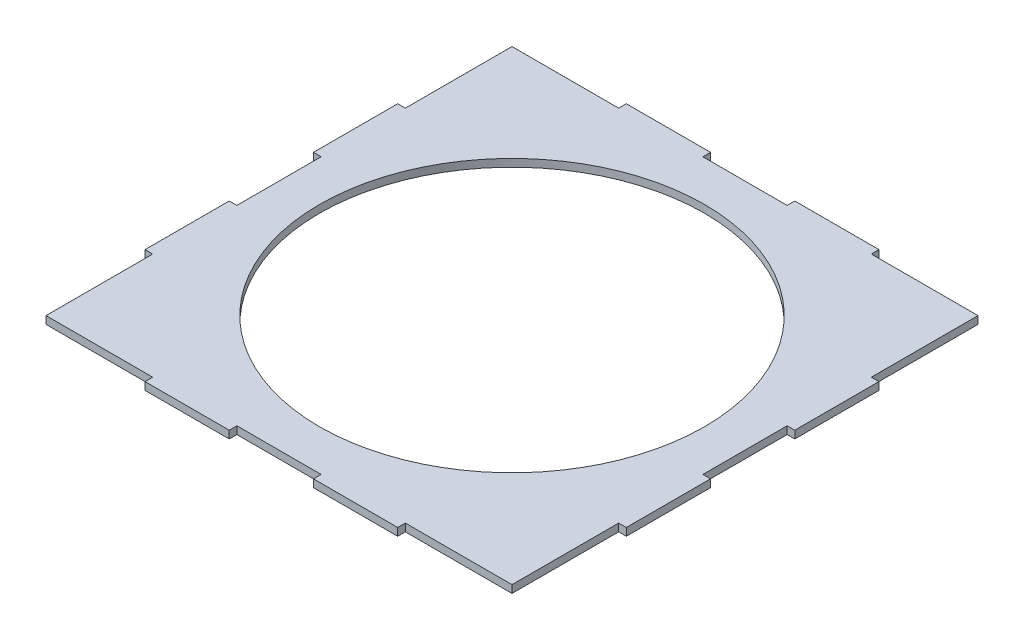
ISO-10303-21;
HEADER;
FILE_DESCRIPTION(('STEP AP214'),'2;1');
FILE_NAME('part.step','',(''),(''),'','','');
FILE_SCHEMA(('AUTOMOTIVE_DESIGN { 1 0 10303 214 1 1 1 1 }'));
ENDSEC;
DATA;
#1=APPLICATION_CONTEXT('core data for automotive mechanical design processes');
#2=APPLICATION_PROTOCOL_DEFINITION('international standard','automotive_design',2000,#1);
#3=PRODUCT_CONTEXT('',#1,'mechanical');
#4=PRODUCT('Part','Part','',(#3));
#5=PRODUCT_RELATED_PRODUCT_CATEGORY('part','',(#4));
#6=PRODUCT_DEFINITION_FORMATION('','',#4);
#7=PRODUCT_DEFINITION_CONTEXT('part definition',#1,'design');
#8=PRODUCT_DEFINITION('design','',#6,#7);
#9=PRODUCT_DEFINITION_SHAPE('','',#8);
#10=(LENGTH_UNIT() NAMED_UNIT(*) SI_UNIT(.MILLI.,.METRE.));
#11=(NAMED_UNIT(*) PLANE_ANGLE_UNIT() SI_UNIT($,.RADIAN.));
#12=(NAMED_UNIT(*) SI_UNIT($,.STERADIAN.) SOLID_ANGLE_UNIT());
#13=UNCERTAINTY_MEASURE_WITH_UNIT(LENGTH_MEASURE(1.E-05),#10,'distance_accuracy_value','');
#14=(GEOMETRIC_REPRESENTATION_CONTEXT(3) GLOBAL_UNCERTAINTY_ASSIGNED_CONTEXT((#13)) GLOBAL_UNIT_ASSIGNED_CONTEXT((#10,
#11,#12)) REPRESENTATION_CONTEXT('',''));
#15=CARTESIAN_POINT('',(0.,0.,0.));
#16=DIRECTION('',(0.,0.,1.));
#17=DIRECTION('',(1.,0.,0.));
#18=AXIS2_PLACEMENT_3D('',#15,#16,#17);
#19=CARTESIAN_POINT('',(-100.,3.175,100.));
#20=DIRECTION('',(0.,0.,-1.));
#21=DIRECTION('',(-1.,0.,0.));
#22=AXIS2_PLACEMENT_3D('',#19,#20,#21);
#23=PLANE('',#22);
#24=DIRECTION('',(0.,1.,0.));
#25=VECTOR('',#24,1.);
#26=CARTESIAN_POINT('',(-52.5,0.,100.));
#27=LINE('',#26,#25);
#28=CARTESIAN_POINT('',(-52.5,0.,100.));
#29=VERTEX_POINT('',#28);
#30=CARTESIAN_POINT('',(-52.5,3.175,100.));
#31=VERTEX_POINT('',#30);
#32=EDGE_CURVE('E277',#29,#31,#27,.T.);
#33=ORIENTED_EDGE('',*,*,#32,.F.);
#34=DIRECTION('',(1.,0.,0.));
#35=VECTOR('',#34,1.);
#36=CARTESIAN_POINT('',(-100.,0.,100.));
#37=LINE('',#36,#35);
#38=CARTESIAN_POINT('',(-17.5,0.,100.));
#39=VERTEX_POINT('',#38);
#40=EDGE_CURVE('E290',#29,#39,#37,.T.);
#41=ORIENTED_EDGE('',*,*,#40,.T.);
#42=DIRECTION('',(0.,1.,0.));
#43=VECTOR('',#42,1.);
#44=CARTESIAN_POINT('',(-17.5,0.,100.));
#45=LINE('',#44,#43);
#46=CARTESIAN_POINT('',(-17.5,3.175,100.));
#47=VERTEX_POINT('',#46);
#48=EDGE_CURVE('E600',#39,#47,#45,.T.);
#49=ORIENTED_EDGE('',*,*,#48,.T.);
#50=DIRECTION('',(1.,0.,0.));
#51=VECTOR('',#50,1.);
#52=CARTESIAN_POINT('',(-100.,3.175,100.));
#53=LINE('',#52,#51);
#54=EDGE_CURVE('E292',#31,#47,#53,.T.);
#55=ORIENTED_EDGE('',*,*,#54,.F.);
#56=EDGE_LOOP('',(#33,#41,#49,#55));
#57=FACE_BOUND('',#56,.T.);
#58=ADVANCED_FACE('F37',(#57),#23,.F.);
#59=DIRECTION('',(0.,1.,0.));
#60=VECTOR('',#59,1.);
#61=CARTESIAN_POINT('',(17.5,0.,100.));
#62=LINE('',#61,#60);
#63=CARTESIAN_POINT('',(17.5,0.,100.));
#64=VERTEX_POINT('',#63);
#65=CARTESIAN_POINT('',(17.5,3.175,100.));
#66=VERTEX_POINT('',#65);
#67=EDGE_CURVE('E603',#64,#66,#62,.T.);
#68=ORIENTED_EDGE('',*,*,#67,.F.);
#69=CARTESIAN_POINT('',(52.5,0.,100.));
#70=VERTEX_POINT('',#69);
#71=EDGE_CURVE('E301',#64,#70,#37,.T.);
#72=ORIENTED_EDGE('',*,*,#71,.T.);
#73=DIRECTION('',(0.,1.,0.));
#74=VECTOR('',#73,1.);
#75=CARTESIAN_POINT('',(52.5,0.,100.));
#76=LINE('',#75,#74);
#77=CARTESIAN_POINT('',(52.5,3.175,100.));
#78=VERTEX_POINT('',#77);
#79=EDGE_CURVE('E581',#70,#78,#76,.T.);
#80=ORIENTED_EDGE('',*,*,#79,.T.);
#81=EDGE_CURVE('E322',#66,#78,#53,.T.);
#82=ORIENTED_EDGE('',*,*,#81,.F.);
#83=EDGE_LOOP('',(#68,#72,#80,#82));
#84=FACE_BOUND('',#83,.T.);
#85=ADVANCED_FACE('F661',(#84),#23,.F.);
#86=CARTESIAN_POINT('',(0.,3.175,0.));
#87=DIRECTION('',(0.,1.,0.));
#88=DIRECTION('',(0.,0.,1.));
#89=AXIS2_PLACEMENT_3D('',#86,#87,#88);
#90=PLANE('',#89);
#91=CARTESIAN_POINT('',(0.,3.175,0.));
#92=DIRECTION('',(0.,1.,0.));
#93=DIRECTION('',(0.,0.,1.));
#94=AXIS2_PLACEMENT_3D('',#91,#92,#93);
#95=CIRCLE('',#94,80.);
#96=CARTESIAN_POINT('',(0.,3.175,80.));
#97=VERTEX_POINT('',#96);
#98=EDGE_CURVE('E642',#97,#97,#95,.T.);
#99=ORIENTED_EDGE('',*,*,#98,.F.);
#100=EDGE_LOOP('',(#99));
#101=FACE_BOUND('',#100,.T.);
#102=DIRECTION('',(0.,0.,-1.));
#103=VECTOR('',#102,1.);
#104=CARTESIAN_POINT('',(-96.825,3.175,100.));
#105=LINE('',#104,#103);
#106=CARTESIAN_POINT('',(-96.825,3.175,96.825));
#107=VERTEX_POINT('',#106);
#108=CARTESIAN_POINT('',(-96.825,3.175,52.5));
#109=VERTEX_POINT('',#108);
#110=EDGE_CURVE('E382',#107,#109,#105,.T.);
#111=ORIENTED_EDGE('',*,*,#110,.F.);
#112=DIRECTION('',(1.,0.,0.));
#113=VECTOR('',#112,1.);
#114=CARTESIAN_POINT('',(-96.825,3.175,96.825));
#115=LINE('',#114,#113);
#116=CARTESIAN_POINT('',(-52.5,3.175,96.825));
#117=VERTEX_POINT('',#116);
#118=EDGE_CURVE('E63',#107,#117,#115,.T.);
#119=ORIENTED_EDGE('',*,*,#118,.T.);
#120=DIRECTION('',(0.,0.,1.));
#121=VECTOR('',#120,1.);
#122=CARTESIAN_POINT('',(-52.5,3.175,100.));
#123=LINE('',#122,#121);
#124=EDGE_CURVE('E613',#117,#31,#123,.T.);
#125=ORIENTED_EDGE('',*,*,#124,.T.);
#126=ORIENTED_EDGE('',*,*,#54,.T.);
#127=DIRECTION('',(0.,0.,-1.));
#128=VECTOR('',#127,1.);
#129=CARTESIAN_POINT('',(-17.5,3.175,100.));
#130=LINE('',#129,#128);
#131=CARTESIAN_POINT('',(-17.5,3.175,96.825));
#132=VERTEX_POINT('',#131);
#133=EDGE_CURVE('E585',#47,#132,#130,.T.);
#134=ORIENTED_EDGE('',*,*,#133,.T.);
#135=DIRECTION('',(1.,0.,0.));
#136=VECTOR('',#135,1.);
#137=CARTESIAN_POINT('',(-17.5,3.175,96.825));
#138=LINE('',#137,#136);
#139=CARTESIAN_POINT('',(17.5,3.175,96.825));
#140=VERTEX_POINT('',#139);
#141=EDGE_CURVE('E614',#132,#140,#138,.T.);
#142=ORIENTED_EDGE('',*,*,#141,.T.);
#143=DIRECTION('',(0.,0.,1.));
#144=VECTOR('',#143,1.);
#145=CARTESIAN_POINT('',(17.5,3.175,100.));
#146=LINE('',#145,#144);
#147=EDGE_CURVE('E618',#140,#66,#146,.T.);
#148=ORIENTED_EDGE('',*,*,#147,.T.);
#149=ORIENTED_EDGE('',*,*,#81,.T.);
#150=DIRECTION('',(0.,0.,-1.));
#151=VECTOR('',#150,1.);
#152=CARTESIAN_POINT('',(52.5,3.175,100.));
#153=LINE('',#152,#151);
#154=CARTESIAN_POINT('',(52.5,3.175,96.825));
#155=VERTEX_POINT('',#154);
#156=EDGE_CURVE('E586',#78,#155,#153,.T.);
#157=ORIENTED_EDGE('',*,*,#156,.T.);
#158=DIRECTION('',(1.,0.,0.));
#159=VECTOR('',#158,1.);
#160=CARTESIAN_POINT('',(96.825,3.175,96.825));
#161=LINE('',#160,#159);
#162=CARTESIAN_POINT('',(96.825,3.175,96.825));
#163=VERTEX_POINT('',#162);
#164=EDGE_CURVE('E591',#155,#163,#161,.T.);
#165=ORIENTED_EDGE('',*,*,#164,.T.);
#166=DIRECTION('',(0.,0.,-1.));
#167=VECTOR('',#166,1.);
#168=CARTESIAN_POINT('',(96.825,3.175,100.));
#169=LINE('',#168,#167);
#170=CARTESIAN_POINT('',(96.825,3.175,52.5));
#171=VERTEX_POINT('',#170);
#172=EDGE_CURVE('E455',#163,#171,#169,.T.);
#173=ORIENTED_EDGE('',*,*,#172,.T.);
#174=DIRECTION('',(1.,0.,0.));
#175=VECTOR('',#174,1.);
#176=CARTESIAN_POINT('',(100.,3.175,52.5));
#177=LINE('',#176,#175);
#178=CARTESIAN_POINT('',(100.,3.175,52.5));
#179=VERTEX_POINT('',#178);
#180=EDGE_CURVE('E459',#171,#179,#177,.T.);
#181=ORIENTED_EDGE('',*,*,#180,.T.);
#182=DIRECTION('',(0.,0.,-1.));
#183=VECTOR('',#182,1.);
#184=CARTESIAN_POINT('',(100.,3.175,-100.));
#185=LINE('',#184,#183);
#186=CARTESIAN_POINT('',(100.,3.175,17.5));
#187=VERTEX_POINT('',#186);
#188=EDGE_CURVE('E317',#179,#187,#185,.T.);
#189=ORIENTED_EDGE('',*,*,#188,.T.);
#190=DIRECTION('',(-1.,0.,0.));
#191=VECTOR('',#190,1.);
#192=CARTESIAN_POINT('',(100.,3.175,17.5));
#193=LINE('',#192,#191);
#194=CARTESIAN_POINT('',(96.825,3.175,17.5));
#195=VERTEX_POINT('',#194);
#196=EDGE_CURVE('E424',#187,#195,#193,.T.);
#197=ORIENTED_EDGE('',*,*,#196,.T.);
#198=DIRECTION('',(0.,0.,-1.));
#199=VECTOR('',#198,1.);
#200=CARTESIAN_POINT('',(96.825,3.175,-17.5));
#201=LINE('',#200,#199);
#202=CARTESIAN_POINT('',(96.825,3.175,-17.5));
#203=VERTEX_POINT('',#202);
#204=EDGE_CURVE('E429',#195,#203,#201,.T.);
#205=ORIENTED_EDGE('',*,*,#204,.T.);
#206=DIRECTION('',(1.,0.,0.));
#207=VECTOR('',#206,1.);
#208=CARTESIAN_POINT('',(100.,3.175,-17.5));
#209=LINE('',#208,#207);
#210=CARTESIAN_POINT('',(100.,3.175,-17.5));
#211=VERTEX_POINT('',#210);
#212=EDGE_CURVE('E433',#203,#211,#209,.T.);
#213=ORIENTED_EDGE('',*,*,#212,.T.);
#214=CARTESIAN_POINT('',(100.,3.175,-52.5));
#215=VERTEX_POINT('',#214);
#216=EDGE_CURVE('E318',#211,#215,#185,.T.);
#217=ORIENTED_EDGE('',*,*,#216,.T.);
#218=DIRECTION('',(-1.,0.,0.));
#219=VECTOR('',#218,1.);
#220=CARTESIAN_POINT('',(96.825,3.175,-52.5));
#221=LINE('',#220,#219);
#222=CARTESIAN_POINT('',(96.825,3.175,-52.5));
#223=VERTEX_POINT('',#222);
#224=EDGE_CURVE('E475',#215,#223,#221,.T.);
#225=ORIENTED_EDGE('',*,*,#224,.T.);
#226=DIRECTION('',(0.,0.,-1.));
#227=VECTOR('',#226,1.);
#228=CARTESIAN_POINT('',(96.825,3.175,-52.5));
#229=LINE('',#228,#227);
#230=CARTESIAN_POINT('',(96.825,3.175,-96.825));
#231=VERTEX_POINT('',#230);
#232=EDGE_CURVE('E454',#223,#231,#229,.T.);
#233=ORIENTED_EDGE('',*,*,#232,.T.);
#234=DIRECTION('',(1.,0.,0.));
#235=VECTOR('',#234,1.);
#236=CARTESIAN_POINT('',(96.825,3.175,-96.825));
#237=LINE('',#236,#235);
#238=CARTESIAN_POINT('',(52.5,3.175,-96.825));
#239=VERTEX_POINT('',#238);
#240=EDGE_CURVE('E500',#239,#231,#237,.T.);
#241=ORIENTED_EDGE('',*,*,#240,.F.);
#242=DIRECTION('',(0.,0.,1.));
#243=VECTOR('',#242,1.);
#244=CARTESIAN_POINT('',(52.5,3.175,-100.));
#245=LINE('',#244,#243);
#246=CARTESIAN_POINT('',(52.5,3.175,-100.));
#247=VERTEX_POINT('',#246);
#248=EDGE_CURVE('E504',#247,#239,#245,.T.);
#249=ORIENTED_EDGE('',*,*,#248,.F.);
#250=DIRECTION('',(-1.,0.,0.));
#251=VECTOR('',#250,1.);
#252=CARTESIAN_POINT('',(-100.,3.175,-100.));
#253=LINE('',#252,#251);
#254=CARTESIAN_POINT('',(17.5,3.175,-100.));
#255=VERTEX_POINT('',#254);
#256=EDGE_CURVE('E11',#247,#255,#253,.T.);
#257=ORIENTED_EDGE('',*,*,#256,.T.);
#258=DIRECTION('',(0.,0.,-1.));
#259=VECTOR('',#258,1.);
#260=CARTESIAN_POINT('',(17.5,3.175,-100.));
#261=LINE('',#260,#259);
#262=CARTESIAN_POINT('',(17.5,3.175,-96.825));
#263=VERTEX_POINT('',#262);
#264=EDGE_CURVE('E530',#263,#255,#261,.T.);
#265=ORIENTED_EDGE('',*,*,#264,.F.);
#266=DIRECTION('',(1.,0.,0.));
#267=VECTOR('',#266,1.);
#268=CARTESIAN_POINT('',(-17.5,3.175,-96.825));
#269=LINE('',#268,#267);
#270=CARTESIAN_POINT('',(-17.5,3.175,-96.825));
#271=VERTEX_POINT('',#270);
#272=EDGE_CURVE('E534',#271,#263,#269,.T.);
#273=ORIENTED_EDGE('',*,*,#272,.F.);
#274=DIRECTION('',(0.,0.,1.));
#275=VECTOR('',#274,1.);
#276=CARTESIAN_POINT('',(-17.5,3.175,-100.));
#277=LINE('',#276,#275);
#278=CARTESIAN_POINT('',(-17.5,3.175,-100.));
#279=VERTEX_POINT('',#278);
#280=EDGE_CURVE('E499',#279,#271,#277,.T.);
#281=ORIENTED_EDGE('',*,*,#280,.F.);
#282=CARTESIAN_POINT('',(-52.5,3.175,-100.));
#283=VERTEX_POINT('',#282);
#284=EDGE_CURVE('E47',#279,#283,#253,.T.);
#285=ORIENTED_EDGE('',*,*,#284,.T.);
#286=DIRECTION('',(0.,0.,-1.));
#287=VECTOR('',#286,1.);
#288=CARTESIAN_POINT('',(-52.5,3.175,-100.));
#289=LINE('',#288,#287);
#290=CARTESIAN_POINT('',(-52.5,3.175,-96.825));
#291=VERTEX_POINT('',#290);
#292=EDGE_CURVE('E561',#291,#283,#289,.T.);
#293=ORIENTED_EDGE('',*,*,#292,.F.);
#294=DIRECTION('',(1.,0.,0.));
#295=VECTOR('',#294,1.);
#296=CARTESIAN_POINT('',(-96.825,3.175,-96.825));
#297=LINE('',#296,#295);
#298=CARTESIAN_POINT('',(-96.825,3.175,-96.825));
#299=VERTEX_POINT('',#298);
#300=EDGE_CURVE('E529',#299,#291,#297,.T.);
#301=ORIENTED_EDGE('',*,*,#300,.F.);
#302=DIRECTION('',(0.,0.,-1.));
#303=VECTOR('',#302,1.);
#304=CARTESIAN_POINT('',(-96.825,3.175,-52.5));
#305=LINE('',#304,#303);
#306=CARTESIAN_POINT('',(-96.825,3.175,-52.5));
#307=VERTEX_POINT('',#306);
#308=EDGE_CURVE('E377',#307,#299,#305,.T.);
#309=ORIENTED_EDGE('',*,*,#308,.F.);
#310=DIRECTION('',(1.,0.,0.));
#311=VECTOR('',#310,1.);
#312=CARTESIAN_POINT('',(-96.825,3.175,-52.5));
#313=LINE('',#312,#311);
#314=CARTESIAN_POINT('',(-100.,3.175,-52.5));
#315=VERTEX_POINT('',#314);
#316=EDGE_CURVE('E397',#315,#307,#313,.T.);
#317=ORIENTED_EDGE('',*,*,#316,.F.);
#318=DIRECTION('',(0.,0.,1.));
#319=VECTOR('',#318,1.);
#320=CARTESIAN_POINT('',(-100.,3.175,-100.));
#321=LINE('',#320,#319);
#322=CARTESIAN_POINT('',(-100.,3.175,-17.5));
#323=VERTEX_POINT('',#322);
#324=EDGE_CURVE('E326',#315,#323,#321,.T.);
#325=ORIENTED_EDGE('',*,*,#324,.T.);
#326=DIRECTION('',(-1.,0.,0.));
#327=VECTOR('',#326,1.);
#328=CARTESIAN_POINT('',(-100.,3.175,-17.5));
#329=LINE('',#328,#327);
#330=CARTESIAN_POINT('',(-96.825,3.175,-17.5));
#331=VERTEX_POINT('',#330);
#332=EDGE_CURVE('E345',#331,#323,#329,.T.);
#333=ORIENTED_EDGE('',*,*,#332,.F.);
#334=DIRECTION('',(0.,0.,-1.));
#335=VECTOR('',#334,1.);
#336=CARTESIAN_POINT('',(-96.825,3.175,-17.5));
#337=LINE('',#336,#335);
#338=CARTESIAN_POINT('',(-96.825,3.175,17.5));
#339=VERTEX_POINT('',#338);
#340=EDGE_CURVE('E349',#339,#331,#337,.T.);
#341=ORIENTED_EDGE('',*,*,#340,.F.);
#342=DIRECTION('',(1.,0.,0.));
#343=VECTOR('',#342,1.);
#344=CARTESIAN_POINT('',(-100.,3.175,17.5));
#345=LINE('',#344,#343);
#346=CARTESIAN_POINT('',(-100.,3.175,17.5));
#347=VERTEX_POINT('',#346);
#348=EDGE_CURVE('E353',#347,#339,#345,.T.);
#349=ORIENTED_EDGE('',*,*,#348,.F.);
#350=CARTESIAN_POINT('',(-100.,3.175,52.5));
#351=VERTEX_POINT('',#350);
#352=EDGE_CURVE('E327',#347,#351,#321,.T.);
#353=ORIENTED_EDGE('',*,*,#352,.T.);
#354=DIRECTION('',(-1.,0.,0.));
#355=VECTOR('',#354,1.);
#356=CARTESIAN_POINT('',(-100.,3.175,52.5));
#357=LINE('',#356,#355);
#358=EDGE_CURVE('E378',#109,#351,#357,.T.);
#359=ORIENTED_EDGE('',*,*,#358,.F.);
#360=EDGE_LOOP('',(#111,#119,#125,#126,#134,#142,#148,#149,#157,#165,#173,#181,#189,#197,#205,
#213,#217,#225,#233,#241,#249,#257,#265,#273,#281,#285,#293,#301,#309,#317,#325,#333,#341,#349,
#353,#359));
#361=FACE_BOUND('',#360,.T.);
#362=ADVANCED_FACE('F658',(#101,#361),#90,.T.);
#363=CARTESIAN_POINT('',(0.,0.,0.));
#364=DIRECTION('',(0.,1.,0.));
#365=DIRECTION('',(0.,0.,1.));
#366=AXIS2_PLACEMENT_3D('',#363,#364,#365);
#367=PLANE('',#366);
#368=CARTESIAN_POINT('',(0.,0.,0.));
#369=DIRECTION('',(0.,1.,0.));
#370=DIRECTION('',(0.,0.,1.));
#371=AXIS2_PLACEMENT_3D('',#368,#369,#370);
#372=CIRCLE('',#371,80.);
#373=CARTESIAN_POINT('',(0.,0.,80.));
#374=VERTEX_POINT('',#373);
#375=EDGE_CURVE('E595',#374,#374,#372,.T.);
#376=ORIENTED_EDGE('',*,*,#375,.T.);
#377=EDGE_LOOP('',(#376));
#378=FACE_BOUND('',#377,.T.);
#379=DIRECTION('',(1.,0.,0.));
#380=VECTOR('',#379,1.);
#381=CARTESIAN_POINT('',(-96.825,0.,96.825));
#382=LINE('',#381,#380);
#383=CARTESIAN_POINT('',(-96.825,0.,96.825));
#384=VERTEX_POINT('',#383);
#385=CARTESIAN_POINT('',(-52.5,0.,96.825));
#386=VERTEX_POINT('',#385);
#387=EDGE_CURVE('E284',#384,#386,#382,.T.);
#388=ORIENTED_EDGE('',*,*,#387,.F.);
#389=DIRECTION('',(0.,0.,-1.));
#390=VECTOR('',#389,1.);
#391=CARTESIAN_POINT('',(-96.825,0.,100.));
#392=LINE('',#391,#390);
#393=CARTESIAN_POINT('',(-96.825,0.,52.5));
#394=VERTEX_POINT('',#393);
#395=EDGE_CURVE('E381',#384,#394,#392,.T.);
#396=ORIENTED_EDGE('',*,*,#395,.T.);
#397=DIRECTION('',(-1.,0.,0.));
#398=VECTOR('',#397,1.);
#399=CARTESIAN_POINT('',(-100.,0.,52.5));
#400=LINE('',#399,#398);
#401=CARTESIAN_POINT('',(-100.,0.,52.5));
#402=VERTEX_POINT('',#401);
#403=EDGE_CURVE('E373',#394,#402,#400,.T.);
#404=ORIENTED_EDGE('',*,*,#403,.T.);
#405=DIRECTION('',(0.,0.,1.));
#406=VECTOR('',#405,1.);
#407=CARTESIAN_POINT('',(-100.,0.,-100.));
#408=LINE('',#407,#406);
#409=CARTESIAN_POINT('',(-100.,0.,17.5));
#410=VERTEX_POINT('',#409);
#411=EDGE_CURVE('E310',#410,#402,#408,.T.);
#412=ORIENTED_EDGE('',*,*,#411,.F.);
#413=DIRECTION('',(1.,0.,0.));
#414=VECTOR('',#413,1.);
#415=CARTESIAN_POINT('',(-100.,0.,17.5));
#416=LINE('',#415,#414);
#417=CARTESIAN_POINT('',(-96.825,0.,17.5));
#418=VERTEX_POINT('',#417);
#419=EDGE_CURVE('E348',#410,#418,#416,.T.);
#420=ORIENTED_EDGE('',*,*,#419,.T.);
#421=DIRECTION('',(0.,0.,-1.));
#422=VECTOR('',#421,1.);
#423=CARTESIAN_POINT('',(-96.825,0.,-17.5));
#424=LINE('',#423,#422);
#425=CARTESIAN_POINT('',(-96.825,0.,-17.5));
#426=VERTEX_POINT('',#425);
#427=EDGE_CURVE('E361',#418,#426,#424,.T.);
#428=ORIENTED_EDGE('',*,*,#427,.T.);
#429=DIRECTION('',(-1.,0.,0.));
#430=VECTOR('',#429,1.);
#431=CARTESIAN_POINT('',(-100.,0.,-17.5));
#432=LINE('',#431,#430);
#433=CARTESIAN_POINT('',(-100.,0.,-17.5));
#434=VERTEX_POINT('',#433);
#435=EDGE_CURVE('E336',#426,#434,#432,.T.);
#436=ORIENTED_EDGE('',*,*,#435,.T.);
#437=CARTESIAN_POINT('',(-100.,0.,-52.5));
#438=VERTEX_POINT('',#437);
#439=EDGE_CURVE('E308',#438,#434,#408,.T.);
#440=ORIENTED_EDGE('',*,*,#439,.F.);
#441=DIRECTION('',(1.,0.,0.));
#442=VECTOR('',#441,1.);
#443=CARTESIAN_POINT('',(-96.825,0.,-52.5));
#444=LINE('',#443,#442);
#445=CARTESIAN_POINT('',(-96.825,0.,-52.5));
#446=VERTEX_POINT('',#445);
#447=EDGE_CURVE('E394',#438,#446,#444,.T.);
#448=ORIENTED_EDGE('',*,*,#447,.T.);
#449=DIRECTION('',(0.,0.,-1.));
#450=VECTOR('',#449,1.);
#451=CARTESIAN_POINT('',(-96.825,0.,-52.5));
#452=LINE('',#451,#450);
#453=CARTESIAN_POINT('',(-96.825,0.,-96.825));
#454=VERTEX_POINT('',#453);
#455=EDGE_CURVE('E401',#446,#454,#452,.T.);
#456=ORIENTED_EDGE('',*,*,#455,.T.);
#457=DIRECTION('',(1.,0.,0.));
#458=VECTOR('',#457,1.);
#459=CARTESIAN_POINT('',(-96.825,0.,-96.825));
#460=LINE('',#459,#458);
#461=CARTESIAN_POINT('',(-52.5,0.,-96.825));
#462=VERTEX_POINT('',#461);
#463=EDGE_CURVE('E564',#454,#462,#460,.T.);
#464=ORIENTED_EDGE('',*,*,#463,.T.);
#465=DIRECTION('',(0.,0.,-1.));
#466=VECTOR('',#465,1.);
#467=CARTESIAN_POINT('',(-52.5,0.,-100.));
#468=LINE('',#467,#466);
#469=CARTESIAN_POINT('',(-52.5,0.,-100.));
#470=VERTEX_POINT('',#469);
#471=EDGE_CURVE('E555',#462,#470,#468,.T.);
#472=ORIENTED_EDGE('',*,*,#471,.T.);
#473=DIRECTION('',(-1.,0.,0.));
#474=VECTOR('',#473,1.);
#475=CARTESIAN_POINT('',(-100.,0.,-100.));
#476=LINE('',#475,#474);
#477=CARTESIAN_POINT('',(-17.5,0.,-100.));
#478=VERTEX_POINT('',#477);
#479=EDGE_CURVE('E41',#478,#470,#476,.T.);
#480=ORIENTED_EDGE('',*,*,#479,.F.);
#481=DIRECTION('',(0.,0.,1.));
#482=VECTOR('',#481,1.);
#483=CARTESIAN_POINT('',(-17.5,0.,-100.));
#484=LINE('',#483,#482);
#485=CARTESIAN_POINT('',(-17.5,0.,-96.825));
#486=VERTEX_POINT('',#485);
#487=EDGE_CURVE('E533',#478,#486,#484,.T.);
#488=ORIENTED_EDGE('',*,*,#487,.T.);
#489=DIRECTION('',(1.,0.,0.));
#490=VECTOR('',#489,1.);
#491=CARTESIAN_POINT('',(-17.5,0.,-96.825));
#492=LINE('',#491,#490);
#493=CARTESIAN_POINT('',(17.5,0.,-96.825));
#494=VERTEX_POINT('',#493);
#495=EDGE_CURVE('E544',#486,#494,#492,.T.);
#496=ORIENTED_EDGE('',*,*,#495,.T.);
#497=DIRECTION('',(0.,0.,-1.));
#498=VECTOR('',#497,1.);
#499=CARTESIAN_POINT('',(17.5,0.,-100.));
#500=LINE('',#499,#498);
#501=CARTESIAN_POINT('',(17.5,0.,-100.));
#502=VERTEX_POINT('',#501);
#503=EDGE_CURVE('E519',#494,#502,#500,.T.);
#504=ORIENTED_EDGE('',*,*,#503,.T.);
#505=CARTESIAN_POINT('',(52.5,0.,-100.));
#506=VERTEX_POINT('',#505);
#507=EDGE_CURVE('E331',#506,#502,#476,.T.);
#508=ORIENTED_EDGE('',*,*,#507,.F.);
#509=DIRECTION('',(0.,0.,1.));
#510=VECTOR('',#509,1.);
#511=CARTESIAN_POINT('',(52.5,0.,-100.));
#512=LINE('',#511,#510);
#513=CARTESIAN_POINT('',(52.5,0.,-96.825));
#514=VERTEX_POINT('',#513);
#515=EDGE_CURVE('E503',#506,#514,#512,.T.);
#516=ORIENTED_EDGE('',*,*,#515,.T.);
#517=DIRECTION('',(1.,0.,0.));
#518=VECTOR('',#517,1.);
#519=CARTESIAN_POINT('',(96.825,0.,-96.825));
#520=LINE('',#519,#518);
#521=CARTESIAN_POINT('',(96.825,0.,-96.825));
#522=VERTEX_POINT('',#521);
#523=EDGE_CURVE('E492',#514,#522,#520,.T.);
#524=ORIENTED_EDGE('',*,*,#523,.T.);
#525=DIRECTION('',(0.,0.,-1.));
#526=VECTOR('',#525,1.);
#527=CARTESIAN_POINT('',(96.825,0.,-52.5));
#528=LINE('',#527,#526);
#529=CARTESIAN_POINT('',(96.825,0.,-52.5));
#530=VERTEX_POINT('',#529);
#531=EDGE_CURVE('E479',#530,#522,#528,.T.);
#532=ORIENTED_EDGE('',*,*,#531,.F.);
#533=DIRECTION('',(-1.,0.,0.));
#534=VECTOR('',#533,1.);
#535=CARTESIAN_POINT('',(96.825,0.,-52.5));
#536=LINE('',#535,#534);
#537=CARTESIAN_POINT('',(100.,0.,-52.5));
#538=VERTEX_POINT('',#537);
#539=EDGE_CURVE('E471',#538,#530,#536,.T.);
#540=ORIENTED_EDGE('',*,*,#539,.F.);
#541=DIRECTION('',(0.,0.,-1.));
#542=VECTOR('',#541,1.);
#543=CARTESIAN_POINT('',(100.,0.,-100.));
#544=LINE('',#543,#542);
#545=CARTESIAN_POINT('',(100.,0.,-17.5));
#546=VERTEX_POINT('',#545);
#547=EDGE_CURVE('E300',#546,#538,#544,.T.);
#548=ORIENTED_EDGE('',*,*,#547,.F.);
#549=DIRECTION('',(1.,0.,0.));
#550=VECTOR('',#549,1.);
#551=CARTESIAN_POINT('',(100.,0.,-17.5));
#552=LINE('',#551,#550);
#553=CARTESIAN_POINT('',(96.825,0.,-17.5));
#554=VERTEX_POINT('',#553);
#555=EDGE_CURVE('E428',#554,#546,#552,.T.);
#556=ORIENTED_EDGE('',*,*,#555,.F.);
#557=DIRECTION('',(0.,0.,-1.));
#558=VECTOR('',#557,1.);
#559=CARTESIAN_POINT('',(96.825,0.,-17.5));
#560=LINE('',#559,#558);
#561=CARTESIAN_POINT('',(96.825,0.,17.5));
#562=VERTEX_POINT('',#561);
#563=EDGE_CURVE('E440',#562,#554,#560,.T.);
#564=ORIENTED_EDGE('',*,*,#563,.F.);
#565=DIRECTION('',(-1.,0.,0.));
#566=VECTOR('',#565,1.);
#567=CARTESIAN_POINT('',(100.,0.,17.5));
#568=LINE('',#567,#566);
#569=CARTESIAN_POINT('',(100.,0.,17.5));
#570=VERTEX_POINT('',#569);
#571=EDGE_CURVE('E415',#570,#562,#568,.T.);
#572=ORIENTED_EDGE('',*,*,#571,.F.);
#573=CARTESIAN_POINT('',(100.,0.,52.5));
#574=VERTEX_POINT('',#573);
#575=EDGE_CURVE('E306',#574,#570,#544,.T.);
#576=ORIENTED_EDGE('',*,*,#575,.F.);
#577=DIRECTION('',(1.,0.,0.));
#578=VECTOR('',#577,1.);
#579=CARTESIAN_POINT('',(100.,0.,52.5));
#580=LINE('',#579,#578);
#581=CARTESIAN_POINT('',(96.825,0.,52.5));
#582=VERTEX_POINT('',#581);
#583=EDGE_CURVE('E458',#582,#574,#580,.T.);
#584=ORIENTED_EDGE('',*,*,#583,.F.);
#585=DIRECTION('',(0.,0.,-1.));
#586=VECTOR('',#585,1.);
#587=CARTESIAN_POINT('',(96.825,0.,100.));
#588=LINE('',#587,#586);
#589=CARTESIAN_POINT('',(96.825,0.,96.825));
#590=VERTEX_POINT('',#589);
#591=EDGE_CURVE('E450',#590,#582,#588,.T.);
#592=ORIENTED_EDGE('',*,*,#591,.F.);
#593=DIRECTION('',(1.,0.,0.));
#594=VECTOR('',#593,1.);
#595=CARTESIAN_POINT('',(96.825,0.,96.825));
#596=LINE('',#595,#594);
#597=CARTESIAN_POINT('',(52.5,0.,96.825));
#598=VERTEX_POINT('',#597);
#599=EDGE_CURVE('E590',#598,#590,#596,.T.);
#600=ORIENTED_EDGE('',*,*,#599,.F.);
#601=DIRECTION('',(0.,0.,-1.));
#602=VECTOR('',#601,1.);
#603=CARTESIAN_POINT('',(52.5,0.,100.));
#604=LINE('',#603,#602);
#605=EDGE_CURVE('E578',#70,#598,#604,.T.);
#606=ORIENTED_EDGE('',*,*,#605,.F.);
#607=ORIENTED_EDGE('',*,*,#71,.F.);
#608=DIRECTION('',(0.,0.,1.));
#609=VECTOR('',#608,1.);
#610=CARTESIAN_POINT('',(17.5,0.,100.));
#611=LINE('',#610,#609);
#612=CARTESIAN_POINT('',(17.5,0.,96.825));
#613=VERTEX_POINT('',#612);
#614=EDGE_CURVE('E627',#613,#64,#611,.T.);
#615=ORIENTED_EDGE('',*,*,#614,.F.);
#616=DIRECTION('',(1.,0.,0.));
#617=VECTOR('',#616,1.);
#618=CARTESIAN_POINT('',(-17.5,0.,96.825));
#619=LINE('',#618,#617);
#620=CARTESIAN_POINT('',(-17.5,0.,96.825));
#621=VERTEX_POINT('',#620);
#622=EDGE_CURVE('E604',#621,#613,#619,.T.);
#623=ORIENTED_EDGE('',*,*,#622,.F.);
#624=DIRECTION('',(0.,0.,-1.));
#625=VECTOR('',#624,1.);
#626=CARTESIAN_POINT('',(-17.5,0.,100.));
#627=LINE('',#626,#625);
#628=EDGE_CURVE('E298',#39,#621,#627,.T.);
#629=ORIENTED_EDGE('',*,*,#628,.F.);
#630=ORIENTED_EDGE('',*,*,#40,.F.);
#631=DIRECTION('',(0.,0.,1.));
#632=VECTOR('',#631,1.);
#633=CARTESIAN_POINT('',(-52.5,0.,100.));
#634=LINE('',#633,#632);
#635=EDGE_CURVE('E273',#386,#29,#634,.T.);
#636=ORIENTED_EDGE('',*,*,#635,.F.);
#637=EDGE_LOOP('',(#388,#396,#404,#412,#420,#428,#436,#440,#448,#456,#464,#472,#480,#488,#496,
#504,#508,#516,#524,#532,#540,#548,#556,#564,#572,#576,#584,#592,#600,#606,#607,#615,#623,#629,
#630,#636));
#638=FACE_BOUND('',#637,.T.);
#639=ADVANCED_FACE('F296',(#378,#638),#367,.F.);
#640=CARTESIAN_POINT('',(-96.825,0.,100.));
#641=DIRECTION('',(1.,0.,0.));
#642=DIRECTION('',(0.,0.,-1.));
#643=AXIS2_PLACEMENT_3D('',#640,#641,#642);
#644=PLANE('',#643);
#645=DIRECTION('',(0.,1.,0.));
#646=VECTOR('',#645,1.);
#647=CARTESIAN_POINT('',(-96.825,0.,96.825));
#648=LINE('',#647,#646);
#649=EDGE_CURVE('E508',#384,#107,#648,.T.);
#650=ORIENTED_EDGE('',*,*,#649,.T.);
#651=ORIENTED_EDGE('',*,*,#110,.T.);
#652=DIRECTION('',(0.,1.,0.));
#653=VECTOR('',#652,1.);
#654=CARTESIAN_POINT('',(-96.825,0.,52.5));
#655=LINE('',#654,#653);
#656=EDGE_CURVE('E368',#394,#109,#655,.T.);
#657=ORIENTED_EDGE('',*,*,#656,.F.);
#658=ORIENTED_EDGE('',*,*,#395,.F.);
#659=EDGE_LOOP('',(#650,#651,#657,#658));
#660=FACE_BOUND('',#659,.T.);
#661=ADVANCED_FACE('F667',(#660),#644,.F.);
#662=CARTESIAN_POINT('',(96.825,0.,100.));
#663=DIRECTION('',(1.,0.,0.));
#664=DIRECTION('',(0.,0.,-1.));
#665=AXIS2_PLACEMENT_3D('',#662,#663,#664);
#666=PLANE('',#665);
#667=ORIENTED_EDGE('',*,*,#172,.F.);
#668=DIRECTION('',(0.,1.,0.));
#669=VECTOR('',#668,1.);
#670=CARTESIAN_POINT('',(96.825,0.,96.825));
#671=LINE('',#670,#669);
#672=EDGE_CURVE('E574',#590,#163,#671,.T.);
#673=ORIENTED_EDGE('',*,*,#672,.F.);
#674=ORIENTED_EDGE('',*,*,#591,.T.);
#675=DIRECTION('',(0.,1.,0.));
#676=VECTOR('',#675,1.);
#677=CARTESIAN_POINT('',(96.825,0.,52.5));
#678=LINE('',#677,#676);
#679=EDGE_CURVE('E449',#582,#171,#678,.T.);
#680=ORIENTED_EDGE('',*,*,#679,.T.);
#681=EDGE_LOOP('',(#667,#673,#674,#680));
#682=FACE_BOUND('',#681,.T.);
#683=ADVANCED_FACE('F769',(#682),#666,.T.);
#684=CARTESIAN_POINT('',(-100.,3.175,-100.));
#685=DIRECTION('',(0.,0.,1.));
#686=DIRECTION('',(1.,0.,0.));
#687=AXIS2_PLACEMENT_3D('',#684,#685,#686);
#688=PLANE('',#687);
#689=ORIENTED_EDGE('',*,*,#479,.T.);
#690=DIRECTION('',(0.,1.,0.));
#691=VECTOR('',#690,1.);
#692=CARTESIAN_POINT('',(-52.5,0.,-100.));
#693=LINE('',#692,#691);
#694=EDGE_CURVE('E463',#470,#283,#693,.T.);
#695=ORIENTED_EDGE('',*,*,#694,.T.);
#696=ORIENTED_EDGE('',*,*,#284,.F.);
#697=DIRECTION('',(0.,1.,0.));
#698=VECTOR('',#697,1.);
#699=CARTESIAN_POINT('',(-17.5,0.,-100.));
#700=LINE('',#699,#698);
#701=EDGE_CURVE('E526',#478,#279,#700,.T.);
#702=ORIENTED_EDGE('',*,*,#701,.F.);
#703=EDGE_LOOP('',(#689,#695,#696,#702));
#704=FACE_BOUND('',#703,.T.);
#705=ADVANCED_FACE('F713',(#704),#688,.F.);
#706=CARTESIAN_POINT('',(100.,3.175,-100.));
#707=DIRECTION('',(-1.,0.,0.));
#708=DIRECTION('',(0.,0.,1.));
#709=AXIS2_PLACEMENT_3D('',#706,#707,#708);
#710=PLANE('',#709);
#711=DIRECTION('',(0.,1.,0.));
#712=VECTOR('',#711,1.);
#713=CARTESIAN_POINT('',(100.,0.,52.5));
#714=LINE('',#713,#712);
#715=EDGE_CURVE('E446',#574,#179,#714,.T.);
#716=ORIENTED_EDGE('',*,*,#715,.F.);
#717=ORIENTED_EDGE('',*,*,#575,.T.);
#718=DIRECTION('',(0.,1.,0.));
#719=VECTOR('',#718,1.);
#720=CARTESIAN_POINT('',(100.,0.,17.5));
#721=LINE('',#720,#719);
#722=EDGE_CURVE('E385',#570,#187,#721,.T.);
#723=ORIENTED_EDGE('',*,*,#722,.T.);
#724=ORIENTED_EDGE('',*,*,#188,.F.);
#725=EDGE_LOOP('',(#716,#717,#723,#724));
#726=FACE_BOUND('',#725,.T.);
#727=ADVANCED_FACE('F729',(#726),#710,.F.);
#728=DIRECTION('',(0.,1.,0.));
#729=VECTOR('',#728,1.);
#730=CARTESIAN_POINT('',(100.,0.,-52.5));
#731=LINE('',#730,#729);
#732=EDGE_CURVE('E437',#538,#215,#731,.T.);
#733=ORIENTED_EDGE('',*,*,#732,.T.);
#734=ORIENTED_EDGE('',*,*,#216,.F.);
#735=DIRECTION('',(0.,1.,0.));
#736=VECTOR('',#735,1.);
#737=CARTESIAN_POINT('',(100.,0.,-17.5));
#738=LINE('',#737,#736);
#739=EDGE_CURVE('E411',#546,#211,#738,.T.);
#740=ORIENTED_EDGE('',*,*,#739,.F.);
#741=ORIENTED_EDGE('',*,*,#547,.T.);
#742=EDGE_LOOP('',(#733,#734,#740,#741));
#743=FACE_BOUND('',#742,.T.);
#744=ADVANCED_FACE('F796',(#743),#710,.F.);
#745=ORIENTED_EDGE('',*,*,#507,.T.);
#746=DIRECTION('',(0.,1.,0.));
#747=VECTOR('',#746,1.);
#748=CARTESIAN_POINT('',(17.5,0.,-100.));
#749=LINE('',#748,#747);
#750=EDGE_CURVE('E522',#502,#255,#749,.T.);
#751=ORIENTED_EDGE('',*,*,#750,.T.);
#752=ORIENTED_EDGE('',*,*,#256,.F.);
#753=DIRECTION('',(0.,1.,0.));
#754=VECTOR('',#753,1.);
#755=CARTESIAN_POINT('',(52.5,0.,-100.));
#756=LINE('',#755,#754);
#757=EDGE_CURVE('E488',#506,#247,#756,.T.);
#758=ORIENTED_EDGE('',*,*,#757,.F.);
#759=EDGE_LOOP('',(#745,#751,#752,#758));
#760=FACE_BOUND('',#759,.T.);
#761=ADVANCED_FACE('F797',(#760),#688,.F.);
#762=CARTESIAN_POINT('',(-100.,3.175,-100.));
#763=DIRECTION('',(1.,0.,0.));
#764=DIRECTION('',(0.,0.,-1.));
#765=AXIS2_PLACEMENT_3D('',#762,#763,#764);
#766=PLANE('',#765);
#767=ORIENTED_EDGE('',*,*,#324,.F.);
#768=DIRECTION('',(0.,1.,0.));
#769=VECTOR('',#768,1.);
#770=CARTESIAN_POINT('',(-100.,0.,-52.5));
#771=LINE('',#770,#769);
#772=EDGE_CURVE('E391',#438,#315,#771,.T.);
#773=ORIENTED_EDGE('',*,*,#772,.F.);
#774=ORIENTED_EDGE('',*,*,#439,.T.);
#775=DIRECTION('',(0.,1.,0.));
#776=VECTOR('',#775,1.);
#777=CARTESIAN_POINT('',(-100.,0.,-17.5));
#778=LINE('',#777,#776);
#779=EDGE_CURVE('E313',#434,#323,#778,.T.);
#780=ORIENTED_EDGE('',*,*,#779,.T.);
#781=EDGE_LOOP('',(#767,#773,#774,#780));
#782=FACE_BOUND('',#781,.T.);
#783=ADVANCED_FACE('F692',(#782),#766,.F.);
#784=ORIENTED_EDGE('',*,*,#411,.T.);
#785=DIRECTION('',(0.,1.,0.));
#786=VECTOR('',#785,1.);
#787=CARTESIAN_POINT('',(-100.,0.,52.5));
#788=LINE('',#787,#786);
#789=EDGE_CURVE('E372',#402,#351,#788,.T.);
#790=ORIENTED_EDGE('',*,*,#789,.T.);
#791=ORIENTED_EDGE('',*,*,#352,.F.);
#792=DIRECTION('',(0.,1.,0.));
#793=VECTOR('',#792,1.);
#794=CARTESIAN_POINT('',(-100.,0.,17.5));
#795=LINE('',#794,#793);
#796=EDGE_CURVE('E332',#410,#347,#795,.T.);
#797=ORIENTED_EDGE('',*,*,#796,.F.);
#798=EDGE_LOOP('',(#784,#790,#791,#797));
#799=FACE_BOUND('',#798,.T.);
#800=ADVANCED_FACE('F39',(#799),#766,.F.);
#801=CARTESIAN_POINT('',(-100.,0.,-17.5));
#802=DIRECTION('',(0.,0.,-1.));
#803=DIRECTION('',(-1.,0.,0.));
#804=AXIS2_PLACEMENT_3D('',#801,#802,#803);
#805=PLANE('',#804);
#806=ORIENTED_EDGE('',*,*,#332,.T.);
#807=ORIENTED_EDGE('',*,*,#779,.F.);
#808=ORIENTED_EDGE('',*,*,#435,.F.);
#809=DIRECTION('',(0.,1.,0.));
#810=VECTOR('',#809,1.);
#811=CARTESIAN_POINT('',(-96.825,0.,-17.5));
#812=LINE('',#811,#810);
#813=EDGE_CURVE('E339',#426,#331,#812,.T.);
#814=ORIENTED_EDGE('',*,*,#813,.T.);
#815=EDGE_LOOP('',(#806,#807,#808,#814));
#816=FACE_BOUND('',#815,.T.);
#817=ADVANCED_FACE('F807',(#816),#805,.F.);
#818=CARTESIAN_POINT('',(-96.825,0.,-17.5));
#819=DIRECTION('',(1.,0.,0.));
#820=DIRECTION('',(0.,0.,-1.));
#821=AXIS2_PLACEMENT_3D('',#818,#819,#820);
#822=PLANE('',#821);
#823=ORIENTED_EDGE('',*,*,#340,.T.);
#824=ORIENTED_EDGE('',*,*,#813,.F.);
#825=ORIENTED_EDGE('',*,*,#427,.F.);
#826=DIRECTION('',(0.,1.,0.));
#827=VECTOR('',#826,1.);
#828=CARTESIAN_POINT('',(-96.825,0.,17.5));
#829=LINE('',#828,#827);
#830=EDGE_CURVE('E335',#418,#339,#829,.T.);
#831=ORIENTED_EDGE('',*,*,#830,.T.);
#832=EDGE_LOOP('',(#823,#824,#825,#831));
#833=FACE_BOUND('',#832,.T.);
#834=ADVANCED_FACE('F684',(#833),#822,.F.);
#835=CARTESIAN_POINT('',(-100.,0.,17.5));
#836=DIRECTION('',(0.,0.,1.));
#837=DIRECTION('',(1.,0.,0.));
#838=AXIS2_PLACEMENT_3D('',#835,#836,#837);
#839=PLANE('',#838);
#840=ORIENTED_EDGE('',*,*,#348,.T.);
#841=ORIENTED_EDGE('',*,*,#830,.F.);
#842=ORIENTED_EDGE('',*,*,#419,.F.);
#843=ORIENTED_EDGE('',*,*,#796,.T.);
#844=EDGE_LOOP('',(#840,#841,#842,#843));
#845=FACE_BOUND('',#844,.T.);
#846=ADVANCED_FACE('F678',(#845),#839,.F.);
#847=CARTESIAN_POINT('',(-96.825,0.,-52.5));
#848=DIRECTION('',(1.,0.,0.));
#849=DIRECTION('',(0.,0.,-1.));
#850=AXIS2_PLACEMENT_3D('',#847,#848,#849);
#851=PLANE('',#850);
#852=ORIENTED_EDGE('',*,*,#308,.T.);
#853=DIRECTION('',(0.,1.,0.));
#854=VECTOR('',#853,1.);
#855=CARTESIAN_POINT('',(-96.825,0.,-96.825));
#856=LINE('',#855,#854);
#857=EDGE_CURVE('E551',#454,#299,#856,.T.);
#858=ORIENTED_EDGE('',*,*,#857,.F.);
#859=ORIENTED_EDGE('',*,*,#455,.F.);
#860=DIRECTION('',(0.,1.,0.));
#861=VECTOR('',#860,1.);
#862=CARTESIAN_POINT('',(-96.825,0.,-52.5));
#863=LINE('',#862,#861);
#864=EDGE_CURVE('E357',#446,#307,#863,.T.);
#865=ORIENTED_EDGE('',*,*,#864,.T.);
#866=EDGE_LOOP('',(#852,#858,#859,#865));
#867=FACE_BOUND('',#866,.T.);
#868=ADVANCED_FACE('F703',(#867),#851,.F.);
#869=CARTESIAN_POINT('',(-96.825,0.,-52.5));
#870=DIRECTION('',(0.,0.,1.));
#871=DIRECTION('',(1.,0.,0.));
#872=AXIS2_PLACEMENT_3D('',#869,#870,#871);
#873=PLANE('',#872);
#874=ORIENTED_EDGE('',*,*,#316,.T.);
#875=ORIENTED_EDGE('',*,*,#864,.F.);
#876=ORIENTED_EDGE('',*,*,#447,.F.);
#877=ORIENTED_EDGE('',*,*,#772,.T.);
#878=EDGE_LOOP('',(#874,#875,#876,#877));
#879=FACE_BOUND('',#878,.T.);
#880=ADVANCED_FACE('F696',(#879),#873,.F.);
#881=CARTESIAN_POINT('',(-100.,0.,52.5));
#882=DIRECTION('',(0.,0.,-1.));
#883=DIRECTION('',(-1.,0.,0.));
#884=AXIS2_PLACEMENT_3D('',#881,#882,#883);
#885=PLANE('',#884);
#886=ORIENTED_EDGE('',*,*,#358,.T.);
#887=ORIENTED_EDGE('',*,*,#789,.F.);
#888=ORIENTED_EDGE('',*,*,#403,.F.);
#889=ORIENTED_EDGE('',*,*,#656,.T.);
#890=EDGE_LOOP('',(#886,#887,#888,#889));
#891=FACE_BOUND('',#890,.T.);
#892=ADVANCED_FACE('F671',(#891),#885,.F.);
#893=CARTESIAN_POINT('',(100.,0.,17.5));
#894=DIRECTION('',(0.,0.,-1.));
#895=DIRECTION('',(-1.,0.,0.));
#896=AXIS2_PLACEMENT_3D('',#893,#894,#895);
#897=PLANE('',#896);
#898=ORIENTED_EDGE('',*,*,#196,.F.);
#899=ORIENTED_EDGE('',*,*,#722,.F.);
#900=ORIENTED_EDGE('',*,*,#571,.T.);
#901=DIRECTION('',(0.,1.,0.));
#902=VECTOR('',#901,1.);
#903=CARTESIAN_POINT('',(96.825,0.,17.5));
#904=LINE('',#903,#902);
#905=EDGE_CURVE('E418',#562,#195,#904,.T.);
#906=ORIENTED_EDGE('',*,*,#905,.T.);
#907=EDGE_LOOP('',(#898,#899,#900,#906));
#908=FACE_BOUND('',#907,.T.);
#909=ADVANCED_FACE('F739',(#908),#897,.T.);
#910=CARTESIAN_POINT('',(96.825,0.,-17.5));
#911=DIRECTION('',(1.,0.,0.));
#912=DIRECTION('',(0.,0.,-1.));
#913=AXIS2_PLACEMENT_3D('',#910,#911,#912);
#914=PLANE('',#913);
#915=ORIENTED_EDGE('',*,*,#204,.F.);
#916=ORIENTED_EDGE('',*,*,#905,.F.);
#917=ORIENTED_EDGE('',*,*,#563,.T.);
#918=DIRECTION('',(0.,1.,0.));
#919=VECTOR('',#918,1.);
#920=CARTESIAN_POINT('',(96.825,0.,-17.5));
#921=LINE('',#920,#919);
#922=EDGE_CURVE('E414',#554,#203,#921,.T.);
#923=ORIENTED_EDGE('',*,*,#922,.T.);
#924=EDGE_LOOP('',(#915,#916,#917,#923));
#925=FACE_BOUND('',#924,.T.);
#926=ADVANCED_FACE('F742',(#925),#914,.T.);
#927=CARTESIAN_POINT('',(100.,0.,-17.5));
#928=DIRECTION('',(0.,0.,1.));
#929=DIRECTION('',(1.,0.,0.));
#930=AXIS2_PLACEMENT_3D('',#927,#928,#929);
#931=PLANE('',#930);
#932=ORIENTED_EDGE('',*,*,#212,.F.);
#933=ORIENTED_EDGE('',*,*,#922,.F.);
#934=ORIENTED_EDGE('',*,*,#555,.T.);
#935=ORIENTED_EDGE('',*,*,#739,.T.);
#936=EDGE_LOOP('',(#932,#933,#934,#935));
#937=FACE_BOUND('',#936,.T.);
#938=ADVANCED_FACE('F818',(#937),#931,.T.);
#939=CARTESIAN_POINT('',(96.825,0.,-52.5));
#940=DIRECTION('',(1.,0.,0.));
#941=DIRECTION('',(0.,0.,-1.));
#942=AXIS2_PLACEMENT_3D('',#939,#940,#941);
#943=PLANE('',#942);
#944=DIRECTION('',(0.,1.,0.));
#945=VECTOR('',#944,1.);
#946=CARTESIAN_POINT('',(96.825,0.,-96.825));
#947=LINE('',#946,#945);
#948=EDGE_CURVE('E495',#522,#231,#947,.T.);
#949=ORIENTED_EDGE('',*,*,#948,.T.);
#950=ORIENTED_EDGE('',*,*,#232,.F.);
#951=DIRECTION('',(0.,1.,0.));
#952=VECTOR('',#951,1.);
#953=CARTESIAN_POINT('',(96.825,0.,-52.5));
#954=LINE('',#953,#952);
#955=EDGE_CURVE('E468',#530,#223,#954,.T.);
#956=ORIENTED_EDGE('',*,*,#955,.F.);
#957=ORIENTED_EDGE('',*,*,#531,.T.);
#958=EDGE_LOOP('',(#949,#950,#956,#957));
#959=FACE_BOUND('',#958,.T.);
#960=ADVANCED_FACE('F784',(#959),#943,.T.);
#961=CARTESIAN_POINT('',(96.825,0.,-52.5));
#962=DIRECTION('',(0.,0.,-1.));
#963=DIRECTION('',(-1.,0.,0.));
#964=AXIS2_PLACEMENT_3D('',#961,#962,#963);
#965=PLANE('',#964);
#966=ORIENTED_EDGE('',*,*,#224,.F.);
#967=ORIENTED_EDGE('',*,*,#732,.F.);
#968=ORIENTED_EDGE('',*,*,#539,.T.);
#969=ORIENTED_EDGE('',*,*,#955,.T.);
#970=EDGE_LOOP('',(#966,#967,#968,#969));
#971=FACE_BOUND('',#970,.T.);
#972=ADVANCED_FACE('F775',(#971),#965,.T.);
#973=CARTESIAN_POINT('',(100.,0.,52.5));
#974=DIRECTION('',(0.,0.,1.));
#975=DIRECTION('',(1.,0.,0.));
#976=AXIS2_PLACEMENT_3D('',#973,#974,#975);
#977=PLANE('',#976);
#978=ORIENTED_EDGE('',*,*,#180,.F.);
#979=ORIENTED_EDGE('',*,*,#679,.F.);
#980=ORIENTED_EDGE('',*,*,#583,.T.);
#981=ORIENTED_EDGE('',*,*,#715,.T.);
#982=EDGE_LOOP('',(#978,#979,#980,#981));
#983=FACE_BOUND('',#982,.T.);
#984=ADVANCED_FACE('F772',(#983),#977,.T.);
#985=CARTESIAN_POINT('',(96.825,0.,-96.825));
#986=DIRECTION('',(0.,0.,1.));
#987=DIRECTION('',(1.,0.,0.));
#988=AXIS2_PLACEMENT_3D('',#985,#986,#987);
#989=PLANE('',#988);
#990=ORIENTED_EDGE('',*,*,#240,.T.);
#991=ORIENTED_EDGE('',*,*,#948,.F.);
#992=ORIENTED_EDGE('',*,*,#523,.F.);
#993=DIRECTION('',(0.,1.,0.));
#994=VECTOR('',#993,1.);
#995=CARTESIAN_POINT('',(52.5,0.,-96.825));
#996=LINE('',#995,#994);
#997=EDGE_CURVE('E491',#514,#239,#996,.T.);
#998=ORIENTED_EDGE('',*,*,#997,.T.);
#999=EDGE_LOOP('',(#990,#991,#992,#998));
#1000=FACE_BOUND('',#999,.T.);
#1001=ADVANCED_FACE('F774',(#1000),#989,.F.);
#1002=CARTESIAN_POINT('',(52.5,0.,-100.));
#1003=DIRECTION('',(-1.,0.,0.));
#1004=DIRECTION('',(0.,0.,1.));
#1005=AXIS2_PLACEMENT_3D('',#1002,#1003,#1004);
#1006=PLANE('',#1005);
#1007=ORIENTED_EDGE('',*,*,#248,.T.);
#1008=ORIENTED_EDGE('',*,*,#997,.F.);
#1009=ORIENTED_EDGE('',*,*,#515,.F.);
#1010=ORIENTED_EDGE('',*,*,#757,.T.);
#1011=EDGE_LOOP('',(#1007,#1008,#1009,#1010));
#1012=FACE_BOUND('',#1011,.T.);
#1013=ADVANCED_FACE('F781',(#1012),#1006,.F.);
#1014=CARTESIAN_POINT('',(-52.5,0.,-100.));
#1015=DIRECTION('',(1.,0.,0.));
#1016=DIRECTION('',(0.,0.,-1.));
#1017=AXIS2_PLACEMENT_3D('',#1014,#1015,#1016);
#1018=PLANE('',#1017);
#1019=ORIENTED_EDGE('',*,*,#292,.T.);
#1020=ORIENTED_EDGE('',*,*,#694,.F.);
#1021=ORIENTED_EDGE('',*,*,#471,.F.);
#1022=DIRECTION('',(0.,1.,0.));
#1023=VECTOR('',#1022,1.);
#1024=CARTESIAN_POINT('',(-52.5,0.,-96.825));
#1025=LINE('',#1024,#1023);
#1026=EDGE_CURVE('E554',#462,#291,#1025,.T.);
#1027=ORIENTED_EDGE('',*,*,#1026,.T.);
#1028=EDGE_LOOP('',(#1019,#1020,#1021,#1027));
#1029=FACE_BOUND('',#1028,.T.);
#1030=ADVANCED_FACE('F710',(#1029),#1018,.F.);
#1031=CARTESIAN_POINT('',(-96.825,0.,-96.825));
#1032=DIRECTION('',(0.,0.,1.));
#1033=DIRECTION('',(1.,0.,0.));
#1034=AXIS2_PLACEMENT_3D('',#1031,#1032,#1033);
#1035=PLANE('',#1034);
#1036=ORIENTED_EDGE('',*,*,#300,.T.);
#1037=ORIENTED_EDGE('',*,*,#1026,.F.);
#1038=ORIENTED_EDGE('',*,*,#463,.F.);
#1039=ORIENTED_EDGE('',*,*,#857,.T.);
#1040=EDGE_LOOP('',(#1036,#1037,#1038,#1039));
#1041=FACE_BOUND('',#1040,.T.);
#1042=ADVANCED_FACE('F708',(#1041),#1035,.F.);
#1043=CARTESIAN_POINT('',(-17.5,0.,-100.));
#1044=DIRECTION('',(-1.,0.,0.));
#1045=DIRECTION('',(0.,0.,1.));
#1046=AXIS2_PLACEMENT_3D('',#1043,#1044,#1045);
#1047=PLANE('',#1046);
#1048=ORIENTED_EDGE('',*,*,#280,.T.);
#1049=DIRECTION('',(0.,1.,0.));
#1050=VECTOR('',#1049,1.);
#1051=CARTESIAN_POINT('',(-17.5,0.,-96.825));
#1052=LINE('',#1051,#1050);
#1053=EDGE_CURVE('E515',#486,#271,#1052,.T.);
#1054=ORIENTED_EDGE('',*,*,#1053,.F.);
#1055=ORIENTED_EDGE('',*,*,#487,.F.);
#1056=ORIENTED_EDGE('',*,*,#701,.T.);
#1057=EDGE_LOOP('',(#1048,#1054,#1055,#1056));
#1058=FACE_BOUND('',#1057,.T.);
#1059=ADVANCED_FACE('F719',(#1058),#1047,.F.);
#1060=CARTESIAN_POINT('',(17.5,0.,-100.));
#1061=DIRECTION('',(1.,0.,0.));
#1062=DIRECTION('',(0.,0.,-1.));
#1063=AXIS2_PLACEMENT_3D('',#1060,#1061,#1062);
#1064=PLANE('',#1063);
#1065=ORIENTED_EDGE('',*,*,#264,.T.);
#1066=ORIENTED_EDGE('',*,*,#750,.F.);
#1067=ORIENTED_EDGE('',*,*,#503,.F.);
#1068=DIRECTION('',(0.,1.,0.));
#1069=VECTOR('',#1068,1.);
#1070=CARTESIAN_POINT('',(17.5,0.,-96.825));
#1071=LINE('',#1070,#1069);
#1072=EDGE_CURVE('E518',#494,#263,#1071,.T.);
#1073=ORIENTED_EDGE('',*,*,#1072,.T.);
#1074=EDGE_LOOP('',(#1065,#1066,#1067,#1073));
#1075=FACE_BOUND('',#1074,.T.);
#1076=ADVANCED_FACE('F923',(#1075),#1064,.F.);
#1077=CARTESIAN_POINT('',(-17.5,0.,-96.825));
#1078=DIRECTION('',(0.,0.,1.));
#1079=DIRECTION('',(1.,0.,0.));
#1080=AXIS2_PLACEMENT_3D('',#1077,#1078,#1079);
#1081=PLANE('',#1080);
#1082=ORIENTED_EDGE('',*,*,#272,.T.);
#1083=ORIENTED_EDGE('',*,*,#1072,.F.);
#1084=ORIENTED_EDGE('',*,*,#495,.F.);
#1085=ORIENTED_EDGE('',*,*,#1053,.T.);
#1086=EDGE_LOOP('',(#1082,#1083,#1084,#1085));
#1087=FACE_BOUND('',#1086,.T.);
#1088=ADVANCED_FACE('F925',(#1087),#1081,.F.);
#1089=CARTESIAN_POINT('',(52.5,0.,100.));
#1090=DIRECTION('',(1.,0.,0.));
#1091=DIRECTION('',(0.,0.,-1.));
#1092=AXIS2_PLACEMENT_3D('',#1089,#1090,#1091);
#1093=PLANE('',#1092);
#1094=ORIENTED_EDGE('',*,*,#156,.F.);
#1095=ORIENTED_EDGE('',*,*,#79,.F.);
#1096=ORIENTED_EDGE('',*,*,#605,.T.);
#1097=DIRECTION('',(0.,1.,0.));
#1098=VECTOR('',#1097,1.);
#1099=CARTESIAN_POINT('',(52.5,0.,96.825));
#1100=LINE('',#1099,#1098);
#1101=EDGE_CURVE('E577',#598,#155,#1100,.T.);
#1102=ORIENTED_EDGE('',*,*,#1101,.T.);
#1103=EDGE_LOOP('',(#1094,#1095,#1096,#1102));
#1104=FACE_BOUND('',#1103,.T.);
#1105=ADVANCED_FACE('F762',(#1104),#1093,.T.);
#1106=CARTESIAN_POINT('',(96.825,0.,96.825));
#1107=DIRECTION('',(0.,0.,1.));
#1108=DIRECTION('',(1.,0.,0.));
#1109=AXIS2_PLACEMENT_3D('',#1106,#1107,#1108);
#1110=PLANE('',#1109);
#1111=ORIENTED_EDGE('',*,*,#164,.F.);
#1112=ORIENTED_EDGE('',*,*,#1101,.F.);
#1113=ORIENTED_EDGE('',*,*,#599,.T.);
#1114=ORIENTED_EDGE('',*,*,#672,.T.);
#1115=EDGE_LOOP('',(#1111,#1112,#1113,#1114));
#1116=FACE_BOUND('',#1115,.T.);
#1117=ADVANCED_FACE('F766',(#1116),#1110,.T.);
#1118=CARTESIAN_POINT('',(-96.825,0.,96.825));
#1119=DIRECTION('',(0.,0.,1.));
#1120=DIRECTION('',(1.,0.,0.));
#1121=AXIS2_PLACEMENT_3D('',#1118,#1119,#1120);
#1122=PLANE('',#1121);
#1123=ORIENTED_EDGE('',*,*,#118,.F.);
#1124=ORIENTED_EDGE('',*,*,#649,.F.);
#1125=ORIENTED_EDGE('',*,*,#387,.T.);
#1126=DIRECTION('',(0.,1.,0.));
#1127=VECTOR('',#1126,1.);
#1128=CARTESIAN_POINT('',(-52.5,0.,96.825));
#1129=LINE('',#1128,#1127);
#1130=EDGE_CURVE('E279',#386,#117,#1129,.T.);
#1131=ORIENTED_EDGE('',*,*,#1130,.T.);
#1132=EDGE_LOOP('',(#1123,#1124,#1125,#1131));
#1133=FACE_BOUND('',#1132,.T.);
#1134=ADVANCED_FACE('F1012',(#1133),#1122,.T.);
#1135=CARTESIAN_POINT('',(-52.5,0.,100.));
#1136=DIRECTION('',(-1.,0.,0.));
#1137=DIRECTION('',(0.,0.,1.));
#1138=AXIS2_PLACEMENT_3D('',#1135,#1136,#1137);
#1139=PLANE('',#1138);
#1140=ORIENTED_EDGE('',*,*,#124,.F.);
#1141=ORIENTED_EDGE('',*,*,#1130,.F.);
#1142=ORIENTED_EDGE('',*,*,#635,.T.);
#1143=ORIENTED_EDGE('',*,*,#32,.T.);
#1144=EDGE_LOOP('',(#1140,#1141,#1142,#1143));
#1145=FACE_BOUND('',#1144,.T.);
#1146=ADVANCED_FACE('F276',(#1145),#1139,.T.);
#1147=CARTESIAN_POINT('',(-17.5,0.,100.));
#1148=DIRECTION('',(1.,0.,0.));
#1149=DIRECTION('',(0.,0.,-1.));
#1150=AXIS2_PLACEMENT_3D('',#1147,#1148,#1149);
#1151=PLANE('',#1150);
#1152=ORIENTED_EDGE('',*,*,#133,.F.);
#1153=ORIENTED_EDGE('',*,*,#48,.F.);
#1154=ORIENTED_EDGE('',*,*,#628,.T.);
#1155=DIRECTION('',(0.,1.,0.));
#1156=VECTOR('',#1155,1.);
#1157=CARTESIAN_POINT('',(-17.5,0.,96.825));
#1158=LINE('',#1157,#1156);
#1159=EDGE_CURVE('E609',#621,#132,#1158,.T.);
#1160=ORIENTED_EDGE('',*,*,#1159,.T.);
#1161=EDGE_LOOP('',(#1152,#1153,#1154,#1160));
#1162=FACE_BOUND('',#1161,.T.);
#1163=ADVANCED_FACE('F749',(#1162),#1151,.T.);
#1164=CARTESIAN_POINT('',(-17.5,0.,96.825));
#1165=DIRECTION('',(0.,0.,1.));
#1166=DIRECTION('',(1.,0.,0.));
#1167=AXIS2_PLACEMENT_3D('',#1164,#1165,#1166);
#1168=PLANE('',#1167);
#1169=ORIENTED_EDGE('',*,*,#141,.F.);
#1170=ORIENTED_EDGE('',*,*,#1159,.F.);
#1171=ORIENTED_EDGE('',*,*,#622,.T.);
#1172=DIRECTION('',(0.,1.,0.));
#1173=VECTOR('',#1172,1.);
#1174=CARTESIAN_POINT('',(17.5,0.,96.825));
#1175=LINE('',#1174,#1173);
#1176=EDGE_CURVE('E55',#613,#140,#1175,.T.);
#1177=ORIENTED_EDGE('',*,*,#1176,.T.);
#1178=EDGE_LOOP('',(#1169,#1170,#1171,#1177));
#1179=FACE_BOUND('',#1178,.T.);
#1180=ADVANCED_FACE('F752',(#1179),#1168,.T.);
#1181=CARTESIAN_POINT('',(17.5,0.,100.));
#1182=DIRECTION('',(-1.,0.,0.));
#1183=DIRECTION('',(0.,0.,1.));
#1184=AXIS2_PLACEMENT_3D('',#1181,#1182,#1183);
#1185=PLANE('',#1184);
#1186=ORIENTED_EDGE('',*,*,#147,.F.);
#1187=ORIENTED_EDGE('',*,*,#1176,.F.);
#1188=ORIENTED_EDGE('',*,*,#614,.T.);
#1189=ORIENTED_EDGE('',*,*,#67,.T.);
#1190=EDGE_LOOP('',(#1186,#1187,#1188,#1189));
#1191=FACE_BOUND('',#1190,.T.);
#1192=ADVANCED_FACE('F654',(#1191),#1185,.T.);
#1193=CARTESIAN_POINT('',(0.,0.,0.));
#1194=DIRECTION('',(0.,1.,0.));
#1195=DIRECTION('',(0.,0.,1.));
#1196=AXIS2_PLACEMENT_3D('',#1193,#1194,#1195);
#1197=CYLINDRICAL_SURFACE('',#1196,80.);
#1198=ORIENTED_EDGE('',*,*,#375,.F.);
#1199=EDGE_LOOP('',(#1198));
#1200=FACE_BOUND('',#1199,.T.);
#1201=ORIENTED_EDGE('',*,*,#98,.T.);
#1202=EDGE_LOOP('',(#1201));
#1203=FACE_BOUND('',#1202,.T.);
#1204=ADVANCED_FACE('F651',(#1200,#1203),#1197,.F.);
#1205=CLOSED_SHELL('',(#58,#85,#362,#639,#661,#683,#705,#727,#744,#761,#783,#800,#817,#834,#846,
#868,#880,#892,#909,#926,#938,#960,#972,#984,#1001,#1013,#1030,#1042,#1059,#1076,#1088,#1105,
#1117,#1134,#1146,#1163,#1180,#1192,#1204));
#1206=MANIFOLD_SOLID_BREP('B2',#1205);
#1207=ADVANCED_BREP_SHAPE_REPRESENTATION('',(#18,#1206),#14);
#1208=SHAPE_DEFINITION_REPRESENTATION(#9,#1207);
ENDSEC;
END-ISO-10303-21;
